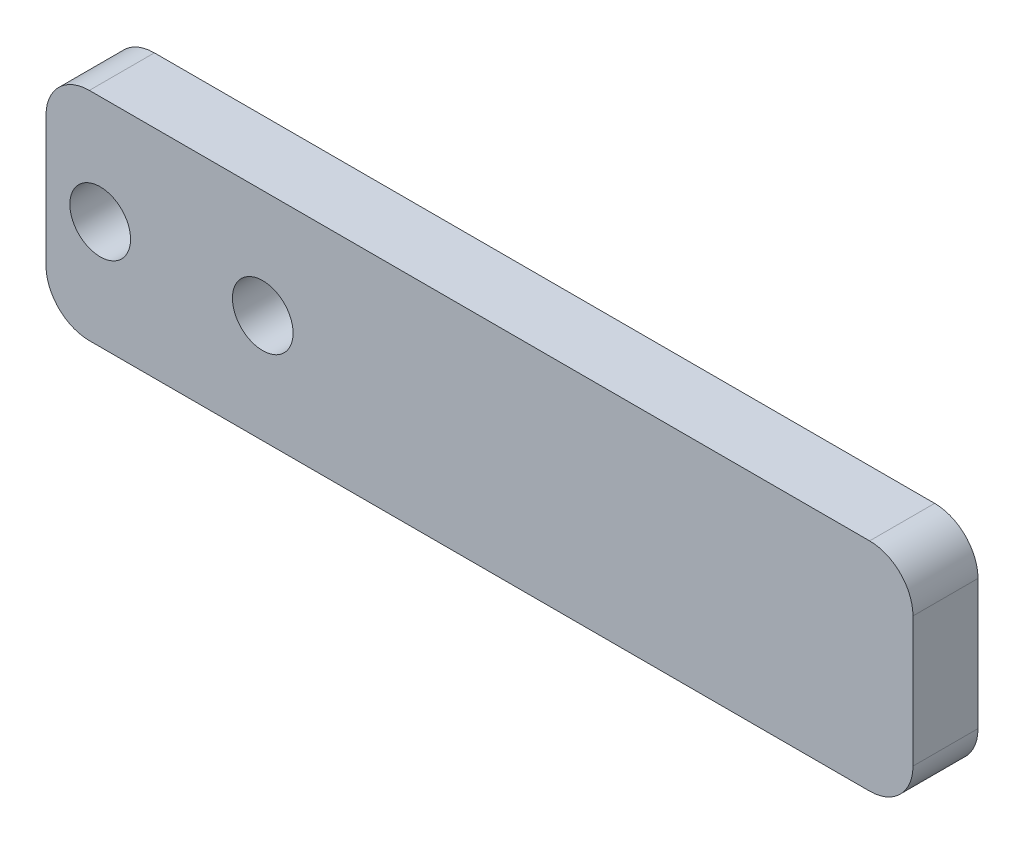
ISO-10303-21;
HEADER;
FILE_DESCRIPTION(('STEP AP214'),'2;1');
FILE_NAME('part.step','',(''),(''),'','','');
FILE_SCHEMA(('AUTOMOTIVE_DESIGN { 1 0 10303 214 1 1 1 1 }'));
ENDSEC;
DATA;
#1=APPLICATION_CONTEXT('core data for automotive mechanical design processes');
#2=APPLICATION_PROTOCOL_DEFINITION('international standard','automotive_design',2000,#1);
#3=PRODUCT_CONTEXT('',#1,'mechanical');
#4=PRODUCT('Part','Part','',(#3));
#5=PRODUCT_RELATED_PRODUCT_CATEGORY('part','',(#4));
#6=PRODUCT_DEFINITION_FORMATION('','',#4);
#7=PRODUCT_DEFINITION_CONTEXT('part definition',#1,'design');
#8=PRODUCT_DEFINITION('design','',#6,#7);
#9=PRODUCT_DEFINITION_SHAPE('','',#8);
#10=(LENGTH_UNIT() NAMED_UNIT(*) SI_UNIT(.MILLI.,.METRE.));
#11=(NAMED_UNIT(*) PLANE_ANGLE_UNIT() SI_UNIT($,.RADIAN.));
#12=(NAMED_UNIT(*) SI_UNIT($,.STERADIAN.) SOLID_ANGLE_UNIT());
#13=UNCERTAINTY_MEASURE_WITH_UNIT(LENGTH_MEASURE(1.E-05),#10,'distance_accuracy_value','');
#14=(GEOMETRIC_REPRESENTATION_CONTEXT(3) GLOBAL_UNCERTAINTY_ASSIGNED_CONTEXT((#13)) GLOBAL_UNIT_ASSIGNED_CONTEXT((#10,
#11,#12)) REPRESENTATION_CONTEXT('',''));
#15=CARTESIAN_POINT('',(0.,0.,0.));
#16=DIRECTION('',(0.,0.,1.));
#17=DIRECTION('',(1.,0.,0.));
#18=AXIS2_PLACEMENT_3D('',#15,#16,#17);
#19=CARTESIAN_POINT('',(0.,0.,3.));
#20=DIRECTION('',(0.,0.,-1.));
#21=DIRECTION('',(-1.,0.,0.));
#22=AXIS2_PLACEMENT_3D('',#19,#20,#21);
#23=PLANE('',#22);
#24=DIRECTION('',(0.,-1.,0.));
#25=VECTOR('',#24,1.);
#26=CARTESIAN_POINT('',(-20.,-5.,3.));
#27=LINE('',#26,#25);
#28=CARTESIAN_POINT('',(-20.,3.,3.));
#29=VERTEX_POINT('',#28);
#30=CARTESIAN_POINT('',(-20.,-3.,3.));
#31=VERTEX_POINT('',#30);
#32=EDGE_CURVE('E176',#29,#31,#27,.T.);
#33=ORIENTED_EDGE('',*,*,#32,.T.);
#34=CARTESIAN_POINT('',(-18.,-3.,3.));
#35=DIRECTION('',(0.,0.,-1.));
#36=DIRECTION('',(-1.,0.,0.));
#37=AXIS2_PLACEMENT_3D('',#34,#35,#36);
#38=CIRCLE('',#37,2.);
#39=CARTESIAN_POINT('',(-18.,-5.,3.));
#40=VERTEX_POINT('',#39);
#41=EDGE_CURVE('E153',#31,#40,#38,.F.);
#42=ORIENTED_EDGE('',*,*,#41,.T.);
#43=DIRECTION('',(1.,0.,0.));
#44=VECTOR('',#43,1.);
#45=CARTESIAN_POINT('',(-20.,-5.,3.));
#46=LINE('',#45,#44);
#47=CARTESIAN_POINT('',(18.,-5.,3.));
#48=VERTEX_POINT('',#47);
#49=EDGE_CURVE('E124',#40,#48,#46,.T.);
#50=ORIENTED_EDGE('',*,*,#49,.T.);
#51=CARTESIAN_POINT('',(18.,-3.,3.));
#52=DIRECTION('',(0.,0.,-1.));
#53=DIRECTION('',(-1.,0.,0.));
#54=AXIS2_PLACEMENT_3D('',#51,#52,#53);
#55=CIRCLE('',#54,2.);
#56=CARTESIAN_POINT('',(20.,-3.,3.));
#57=VERTEX_POINT('',#56);
#58=EDGE_CURVE('E149',#48,#57,#55,.F.);
#59=ORIENTED_EDGE('',*,*,#58,.T.);
#60=DIRECTION('',(0.,1.,0.));
#61=VECTOR('',#60,1.);
#62=CARTESIAN_POINT('',(20.,-5.,3.));
#63=LINE('',#62,#61);
#64=CARTESIAN_POINT('',(20.,3.,3.));
#65=VERTEX_POINT('',#64);
#66=EDGE_CURVE('E132',#57,#65,#63,.T.);
#67=ORIENTED_EDGE('',*,*,#66,.T.);
#68=CARTESIAN_POINT('',(18.,3.,3.));
#69=DIRECTION('',(0.,0.,-1.));
#70=DIRECTION('',(-1.,0.,0.));
#71=AXIS2_PLACEMENT_3D('',#68,#69,#70);
#72=CIRCLE('',#71,2.);
#73=CARTESIAN_POINT('',(18.,5.,3.));
#74=VERTEX_POINT('',#73);
#75=EDGE_CURVE('E59',#65,#74,#72,.F.);
#76=ORIENTED_EDGE('',*,*,#75,.T.);
#77=DIRECTION('',(-1.,0.,0.));
#78=VECTOR('',#77,1.);
#79=CARTESIAN_POINT('',(-20.,5.,3.));
#80=LINE('',#79,#78);
#81=CARTESIAN_POINT('',(-18.,5.,3.));
#82=VERTEX_POINT('',#81);
#83=EDGE_CURVE('E135',#74,#82,#80,.T.);
#84=ORIENTED_EDGE('',*,*,#83,.T.);
#85=CARTESIAN_POINT('',(-18.,3.,3.));
#86=DIRECTION('',(0.,0.,-1.));
#87=DIRECTION('',(-1.,0.,0.));
#88=AXIS2_PLACEMENT_3D('',#85,#86,#87);
#89=CIRCLE('',#88,2.);
#90=EDGE_CURVE('E151',#82,#29,#89,.F.);
#91=ORIENTED_EDGE('',*,*,#90,.T.);
#92=EDGE_LOOP('',(#33,#42,#50,#59,#67,#76,#84,#91));
#93=FACE_BOUND('',#92,.T.);
#94=CARTESIAN_POINT('',(-10.,0.,3.));
#95=DIRECTION('',(0.,0.,1.));
#96=DIRECTION('',(1.,0.,0.));
#97=AXIS2_PLACEMENT_3D('',#94,#95,#96);
#98=CIRCLE('',#97,1.4);
#99=CARTESIAN_POINT('',(-8.6,0.,3.));
#100=VERTEX_POINT('',#99);
#101=EDGE_CURVE('E172',#100,#100,#98,.T.);
#102=ORIENTED_EDGE('',*,*,#101,.F.);
#103=EDGE_LOOP('',(#102));
#104=FACE_BOUND('',#103,.T.);
#105=CARTESIAN_POINT('',(-17.5,0.,3.));
#106=DIRECTION('',(0.,0.,1.));
#107=DIRECTION('',(1.,0.,0.));
#108=AXIS2_PLACEMENT_3D('',#105,#106,#107);
#109=CIRCLE('',#108,1.4);
#110=CARTESIAN_POINT('',(-16.1,0.,3.));
#111=VERTEX_POINT('',#110);
#112=EDGE_CURVE('E182',#111,#111,#109,.T.);
#113=ORIENTED_EDGE('',*,*,#112,.F.);
#114=EDGE_LOOP('',(#113));
#115=FACE_BOUND('',#114,.T.);
#116=ADVANCED_FACE('F37',(#93,#104,#115),#23,.F.);
#117=CARTESIAN_POINT('',(0.,0.,0.));
#118=DIRECTION('',(0.,0.,-1.));
#119=DIRECTION('',(-1.,0.,0.));
#120=AXIS2_PLACEMENT_3D('',#117,#118,#119);
#121=PLANE('',#120);
#122=CARTESIAN_POINT('',(-10.,0.,0.));
#123=DIRECTION('',(0.,0.,1.));
#124=DIRECTION('',(1.,0.,0.));
#125=AXIS2_PLACEMENT_3D('',#122,#123,#124);
#126=CIRCLE('',#125,1.4);
#127=CARTESIAN_POINT('',(-8.6,0.,0.));
#128=VERTEX_POINT('',#127);
#129=EDGE_CURVE('E179',#128,#128,#126,.T.);
#130=ORIENTED_EDGE('',*,*,#129,.T.);
#131=EDGE_LOOP('',(#130));
#132=FACE_BOUND('',#131,.T.);
#133=DIRECTION('',(1.,0.,0.));
#134=VECTOR('',#133,1.);
#135=CARTESIAN_POINT('',(-20.,-5.,0.));
#136=LINE('',#135,#134);
#137=CARTESIAN_POINT('',(-18.,-5.,0.));
#138=VERTEX_POINT('',#137);
#139=CARTESIAN_POINT('',(18.,-5.,0.));
#140=VERTEX_POINT('',#139);
#141=EDGE_CURVE('E121',#138,#140,#136,.T.);
#142=ORIENTED_EDGE('',*,*,#141,.F.);
#143=CARTESIAN_POINT('',(-18.,-3.,0.));
#144=DIRECTION('',(0.,0.,-1.));
#145=DIRECTION('',(-1.,0.,0.));
#146=AXIS2_PLACEMENT_3D('',#143,#144,#145);
#147=CIRCLE('',#146,2.);
#148=CARTESIAN_POINT('',(-20.,-3.,0.));
#149=VERTEX_POINT('',#148);
#150=EDGE_CURVE('E104',#138,#149,#147,.T.);
#151=ORIENTED_EDGE('',*,*,#150,.T.);
#152=DIRECTION('',(0.,-1.,0.));
#153=VECTOR('',#152,1.);
#154=CARTESIAN_POINT('',(-20.,-5.,0.));
#155=LINE('',#154,#153);
#156=CARTESIAN_POINT('',(-20.,3.,0.));
#157=VERTEX_POINT('',#156);
#158=EDGE_CURVE('E133',#157,#149,#155,.T.);
#159=ORIENTED_EDGE('',*,*,#158,.F.);
#160=CARTESIAN_POINT('',(-18.,3.,0.));
#161=DIRECTION('',(0.,0.,-1.));
#162=DIRECTION('',(-1.,0.,0.));
#163=AXIS2_PLACEMENT_3D('',#160,#161,#162);
#164=CIRCLE('',#163,2.);
#165=CARTESIAN_POINT('',(-18.,5.,0.));
#166=VERTEX_POINT('',#165);
#167=EDGE_CURVE('E115',#157,#166,#164,.T.);
#168=ORIENTED_EDGE('',*,*,#167,.T.);
#169=DIRECTION('',(-1.,0.,0.));
#170=VECTOR('',#169,1.);
#171=CARTESIAN_POINT('',(-20.,5.,0.));
#172=LINE('',#171,#170);
#173=CARTESIAN_POINT('',(18.,5.,0.));
#174=VERTEX_POINT('',#173);
#175=EDGE_CURVE('E137',#174,#166,#172,.T.);
#176=ORIENTED_EDGE('',*,*,#175,.F.);
#177=CARTESIAN_POINT('',(18.,3.,0.));
#178=DIRECTION('',(0.,0.,-1.));
#179=DIRECTION('',(-1.,0.,0.));
#180=AXIS2_PLACEMENT_3D('',#177,#178,#179);
#181=CIRCLE('',#180,2.);
#182=CARTESIAN_POINT('',(20.,3.,0.));
#183=VERTEX_POINT('',#182);
#184=EDGE_CURVE('E125',#174,#183,#181,.T.);
#185=ORIENTED_EDGE('',*,*,#184,.T.);
#186=DIRECTION('',(0.,1.,0.));
#187=VECTOR('',#186,1.);
#188=CARTESIAN_POINT('',(20.,-5.,0.));
#189=LINE('',#188,#187);
#190=CARTESIAN_POINT('',(20.,-3.,0.));
#191=VERTEX_POINT('',#190);
#192=EDGE_CURVE('E164',#191,#183,#189,.T.);
#193=ORIENTED_EDGE('',*,*,#192,.F.);
#194=CARTESIAN_POINT('',(18.,-3.,0.));
#195=DIRECTION('',(0.,0.,-1.));
#196=DIRECTION('',(-1.,0.,0.));
#197=AXIS2_PLACEMENT_3D('',#194,#195,#196);
#198=CIRCLE('',#197,2.);
#199=EDGE_CURVE('E131',#191,#140,#198,.T.);
#200=ORIENTED_EDGE('',*,*,#199,.T.);
#201=EDGE_LOOP('',(#142,#151,#159,#168,#176,#185,#193,#200));
#202=FACE_BOUND('',#201,.T.);
#203=CARTESIAN_POINT('',(-17.5,0.,0.));
#204=DIRECTION('',(0.,0.,1.));
#205=DIRECTION('',(1.,0.,0.));
#206=AXIS2_PLACEMENT_3D('',#203,#204,#205);
#207=CIRCLE('',#206,1.4);
#208=CARTESIAN_POINT('',(-16.1,0.,0.));
#209=VERTEX_POINT('',#208);
#210=EDGE_CURVE('E185',#209,#209,#207,.T.);
#211=ORIENTED_EDGE('',*,*,#210,.T.);
#212=EDGE_LOOP('',(#211));
#213=FACE_BOUND('',#212,.T.);
#214=ADVANCED_FACE('F128',(#132,#202,#213),#121,.T.);
#215=CARTESIAN_POINT('',(20.,-5.,3.));
#216=DIRECTION('',(-1.,0.,0.));
#217=DIRECTION('',(0.,0.,1.));
#218=AXIS2_PLACEMENT_3D('',#215,#216,#217);
#219=PLANE('',#218);
#220=ORIENTED_EDGE('',*,*,#66,.F.);
#221=DIRECTION('',(0.,0.,-1.));
#222=VECTOR('',#221,1.);
#223=CARTESIAN_POINT('',(20.,-3.,3.));
#224=LINE('',#223,#222);
#225=EDGE_CURVE('E11',#57,#191,#224,.T.);
#226=ORIENTED_EDGE('',*,*,#225,.T.);
#227=ORIENTED_EDGE('',*,*,#192,.T.);
#228=DIRECTION('',(0.,0.,-1.));
#229=VECTOR('',#228,1.);
#230=CARTESIAN_POINT('',(20.,3.,3.));
#231=LINE('',#230,#229);
#232=EDGE_CURVE('E45',#183,#65,#231,.F.);
#233=ORIENTED_EDGE('',*,*,#232,.T.);
#234=EDGE_LOOP('',(#220,#226,#227,#233));
#235=FACE_BOUND('',#234,.T.);
#236=ADVANCED_FACE('F162',(#235),#219,.F.);
#237=CARTESIAN_POINT('',(-20.,5.,3.));
#238=DIRECTION('',(0.,-1.,0.));
#239=DIRECTION('',(0.,0.,-1.));
#240=AXIS2_PLACEMENT_3D('',#237,#238,#239);
#241=PLANE('',#240);
#242=ORIENTED_EDGE('',*,*,#175,.T.);
#243=DIRECTION('',(0.,0.,-1.));
#244=VECTOR('',#243,1.);
#245=CARTESIAN_POINT('',(-18.,5.,3.));
#246=LINE('',#245,#244);
#247=EDGE_CURVE('E52',#166,#82,#246,.F.);
#248=ORIENTED_EDGE('',*,*,#247,.T.);
#249=ORIENTED_EDGE('',*,*,#83,.F.);
#250=DIRECTION('',(0.,0.,-1.));
#251=VECTOR('',#250,1.);
#252=CARTESIAN_POINT('',(18.,5.,3.));
#253=LINE('',#252,#251);
#254=EDGE_CURVE('E155',#74,#174,#253,.T.);
#255=ORIENTED_EDGE('',*,*,#254,.T.);
#256=EDGE_LOOP('',(#242,#248,#249,#255));
#257=FACE_BOUND('',#256,.T.);
#258=ADVANCED_FACE('F171',(#257),#241,.F.);
#259=CARTESIAN_POINT('',(-20.,-5.,3.));
#260=DIRECTION('',(1.,0.,0.));
#261=DIRECTION('',(0.,0.,-1.));
#262=AXIS2_PLACEMENT_3D('',#259,#260,#261);
#263=PLANE('',#262);
#264=ORIENTED_EDGE('',*,*,#158,.T.);
#265=DIRECTION('',(0.,0.,-1.));
#266=VECTOR('',#265,1.);
#267=CARTESIAN_POINT('',(-20.,-3.,3.));
#268=LINE('',#267,#266);
#269=EDGE_CURVE('E109',#149,#31,#268,.F.);
#270=ORIENTED_EDGE('',*,*,#269,.T.);
#271=ORIENTED_EDGE('',*,*,#32,.F.);
#272=DIRECTION('',(0.,0.,-1.));
#273=VECTOR('',#272,1.);
#274=CARTESIAN_POINT('',(-20.,3.,3.));
#275=LINE('',#274,#273);
#276=EDGE_CURVE('E114',#29,#157,#275,.T.);
#277=ORIENTED_EDGE('',*,*,#276,.T.);
#278=EDGE_LOOP('',(#264,#270,#271,#277));
#279=FACE_BOUND('',#278,.T.);
#280=ADVANCED_FACE('F207',(#279),#263,.F.);
#281=CARTESIAN_POINT('',(-20.,-5.,3.));
#282=DIRECTION('',(0.,1.,0.));
#283=DIRECTION('',(0.,0.,1.));
#284=AXIS2_PLACEMENT_3D('',#281,#282,#283);
#285=PLANE('',#284);
#286=ORIENTED_EDGE('',*,*,#49,.F.);
#287=DIRECTION('',(0.,0.,-1.));
#288=VECTOR('',#287,1.);
#289=CARTESIAN_POINT('',(-18.,-5.,3.));
#290=LINE('',#289,#288);
#291=EDGE_CURVE('E108',#40,#138,#290,.T.);
#292=ORIENTED_EDGE('',*,*,#291,.T.);
#293=ORIENTED_EDGE('',*,*,#141,.T.);
#294=DIRECTION('',(0.,0.,-1.));
#295=VECTOR('',#294,1.);
#296=CARTESIAN_POINT('',(18.,-5.,3.));
#297=LINE('',#296,#295);
#298=EDGE_CURVE('E126',#140,#48,#297,.F.);
#299=ORIENTED_EDGE('',*,*,#298,.T.);
#300=EDGE_LOOP('',(#286,#292,#293,#299));
#301=FACE_BOUND('',#300,.T.);
#302=ADVANCED_FACE('F120',(#301),#285,.F.);
#303=CARTESIAN_POINT('',(-10.,0.,3.));
#304=DIRECTION('',(0.,0.,-1.));
#305=DIRECTION('',(-1.,0.,0.));
#306=AXIS2_PLACEMENT_3D('',#303,#304,#305);
#307=CYLINDRICAL_SURFACE('',#306,1.4);
#308=ORIENTED_EDGE('',*,*,#101,.T.);
#309=EDGE_LOOP('',(#308));
#310=FACE_BOUND('',#309,.T.);
#311=ORIENTED_EDGE('',*,*,#129,.F.);
#312=EDGE_LOOP('',(#311));
#313=FACE_BOUND('',#312,.T.);
#314=ADVANCED_FACE('F202',(#310,#313),#307,.F.);
#315=CARTESIAN_POINT('',(-17.5,0.,3.));
#316=DIRECTION('',(0.,0.,-1.));
#317=DIRECTION('',(-1.,0.,0.));
#318=AXIS2_PLACEMENT_3D('',#315,#316,#317);
#319=CYLINDRICAL_SURFACE('',#318,1.4);
#320=ORIENTED_EDGE('',*,*,#112,.T.);
#321=EDGE_LOOP('',(#320));
#322=FACE_BOUND('',#321,.T.);
#323=ORIENTED_EDGE('',*,*,#210,.F.);
#324=EDGE_LOOP('',(#323));
#325=FACE_BOUND('',#324,.T.);
#326=ADVANCED_FACE('F191',(#322,#325),#319,.F.);
#327=CARTESIAN_POINT('',(-18.,-3.,3.));
#328=DIRECTION('',(0.,0.,-1.));
#329=DIRECTION('',(-1.,0.,0.));
#330=AXIS2_PLACEMENT_3D('',#327,#328,#329);
#331=CYLINDRICAL_SURFACE('',#330,2.);
#332=ORIENTED_EDGE('',*,*,#41,.F.);
#333=ORIENTED_EDGE('',*,*,#269,.F.);
#334=ORIENTED_EDGE('',*,*,#150,.F.);
#335=ORIENTED_EDGE('',*,*,#291,.F.);
#336=EDGE_LOOP('',(#332,#333,#334,#335));
#337=FACE_BOUND('',#336,.T.);
#338=ADVANCED_FACE('F107',(#337),#331,.T.);
#339=CARTESIAN_POINT('',(-18.,3.,3.));
#340=DIRECTION('',(0.,0.,-1.));
#341=DIRECTION('',(-1.,0.,0.));
#342=AXIS2_PLACEMENT_3D('',#339,#340,#341);
#343=CYLINDRICAL_SURFACE('',#342,2.);
#344=ORIENTED_EDGE('',*,*,#90,.F.);
#345=ORIENTED_EDGE('',*,*,#247,.F.);
#346=ORIENTED_EDGE('',*,*,#167,.F.);
#347=ORIENTED_EDGE('',*,*,#276,.F.);
#348=EDGE_LOOP('',(#344,#345,#346,#347));
#349=FACE_BOUND('',#348,.T.);
#350=ADVANCED_FACE('F217',(#349),#343,.T.);
#351=CARTESIAN_POINT('',(18.,-3.,3.));
#352=DIRECTION('',(0.,0.,-1.));
#353=DIRECTION('',(-1.,0.,0.));
#354=AXIS2_PLACEMENT_3D('',#351,#352,#353);
#355=CYLINDRICAL_SURFACE('',#354,2.);
#356=ORIENTED_EDGE('',*,*,#58,.F.);
#357=ORIENTED_EDGE('',*,*,#298,.F.);
#358=ORIENTED_EDGE('',*,*,#199,.F.);
#359=ORIENTED_EDGE('',*,*,#225,.F.);
#360=EDGE_LOOP('',(#356,#357,#358,#359));
#361=FACE_BOUND('',#360,.T.);
#362=ADVANCED_FACE('F219',(#361),#355,.T.);
#363=CARTESIAN_POINT('',(18.,3.,3.));
#364=DIRECTION('',(0.,0.,-1.));
#365=DIRECTION('',(-1.,0.,0.));
#366=AXIS2_PLACEMENT_3D('',#363,#364,#365);
#367=CYLINDRICAL_SURFACE('',#366,2.);
#368=ORIENTED_EDGE('',*,*,#75,.F.);
#369=ORIENTED_EDGE('',*,*,#232,.F.);
#370=ORIENTED_EDGE('',*,*,#184,.F.);
#371=ORIENTED_EDGE('',*,*,#254,.F.);
#372=EDGE_LOOP('',(#368,#369,#370,#371));
#373=FACE_BOUND('',#372,.T.);
#374=ADVANCED_FACE('F39',(#373),#367,.T.);
#375=CLOSED_SHELL('',(#116,#214,#236,#258,#280,#302,#314,#326,#338,#350,#362,#374));
#376=MANIFOLD_SOLID_BREP('B2',#375);
#377=ADVANCED_BREP_SHAPE_REPRESENTATION('',(#18,#376),#14);
#378=SHAPE_DEFINITION_REPRESENTATION(#9,#377);
ENDSEC;
END-ISO-10303-21;
